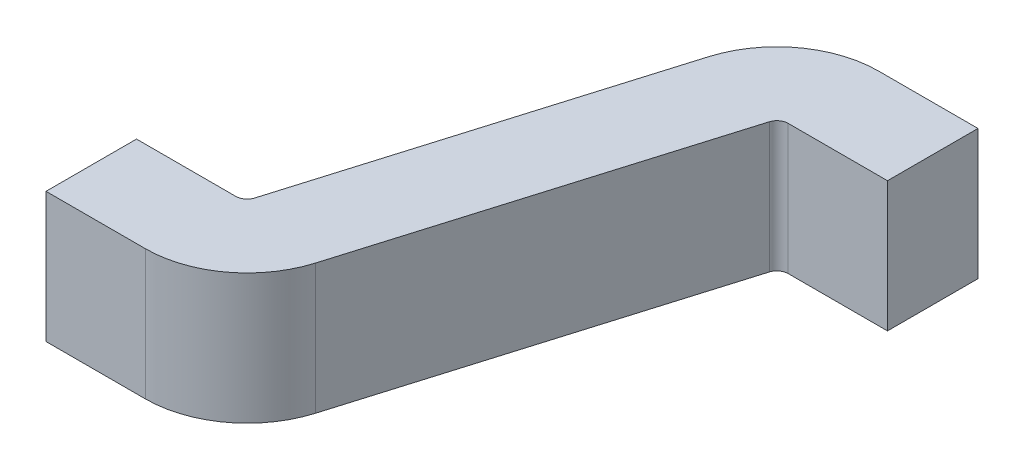
ISO-10303-21;
HEADER;
FILE_DESCRIPTION(('STEP AP214'),'2;1');
FILE_NAME('part.step','',(''),(''),'','','');
FILE_SCHEMA(('AUTOMOTIVE_DESIGN { 1 0 10303 214 1 1 1 1 }'));
ENDSEC;
DATA;
#1=APPLICATION_CONTEXT('core data for automotive mechanical design processes');
#2=APPLICATION_PROTOCOL_DEFINITION('international standard','automotive_design',2000,#1);
#3=PRODUCT_CONTEXT('',#1,'mechanical');
#4=PRODUCT('Part','Part','',(#3));
#5=PRODUCT_RELATED_PRODUCT_CATEGORY('part','',(#4));
#6=PRODUCT_DEFINITION_FORMATION('','',#4);
#7=PRODUCT_DEFINITION_CONTEXT('part definition',#1,'design');
#8=PRODUCT_DEFINITION('design','',#6,#7);
#9=PRODUCT_DEFINITION_SHAPE('','',#8);
#10=(LENGTH_UNIT() NAMED_UNIT(*) SI_UNIT(.MILLI.,.METRE.));
#11=(NAMED_UNIT(*) PLANE_ANGLE_UNIT() SI_UNIT($,.RADIAN.));
#12=(NAMED_UNIT(*) SI_UNIT($,.STERADIAN.) SOLID_ANGLE_UNIT());
#13=UNCERTAINTY_MEASURE_WITH_UNIT(LENGTH_MEASURE(1.E-05),#10,'distance_accuracy_value','');
#14=(GEOMETRIC_REPRESENTATION_CONTEXT(3) GLOBAL_UNCERTAINTY_ASSIGNED_CONTEXT((#13)) GLOBAL_UNIT_ASSIGNED_CONTEXT((#10,
#11,#12)) REPRESENTATION_CONTEXT('',''));
#15=CARTESIAN_POINT('',(0.,0.,0.));
#16=DIRECTION('',(0.,0.,1.));
#17=DIRECTION('',(1.,0.,0.));
#18=AXIS2_PLACEMENT_3D('',#15,#16,#17);
#19=CARTESIAN_POINT('',(0.,0.23,0.16));
#20=DIRECTION('',(1.,0.,0.));
#21=DIRECTION('',(0.,0.,-1.));
#22=AXIS2_PLACEMENT_3D('',#19,#20,#21);
#23=PLANE('',#22);
#24=DIRECTION('',(0.,0.,1.));
#25=VECTOR('',#24,1.);
#26=CARTESIAN_POINT('',(0.,-0.23,0.16));
#27=LINE('',#26,#25);
#28=CARTESIAN_POINT('',(0.,-0.23,-0.16));
#29=VERTEX_POINT('',#28);
#30=CARTESIAN_POINT('',(0.,-0.23,0.16));
#31=VERTEX_POINT('',#30);
#32=EDGE_CURVE('E164',#29,#31,#27,.T.);
#33=ORIENTED_EDGE('',*,*,#32,.T.);
#34=DIRECTION('',(0.,-1.,0.));
#35=VECTOR('',#34,1.);
#36=CARTESIAN_POINT('',(0.,0.23,0.16));
#37=LINE('',#36,#35);
#38=CARTESIAN_POINT('',(0.,0.23,0.16));
#39=VERTEX_POINT('',#38);
#40=EDGE_CURVE('E11',#39,#31,#37,.T.);
#41=ORIENTED_EDGE('',*,*,#40,.F.);
#42=DIRECTION('',(0.,0.,1.));
#43=VECTOR('',#42,1.);
#44=CARTESIAN_POINT('',(0.,0.23,0.16));
#45=LINE('',#44,#43);
#46=CARTESIAN_POINT('',(0.,0.23,-0.16));
#47=VERTEX_POINT('',#46);
#48=EDGE_CURVE('E198',#47,#39,#45,.T.);
#49=ORIENTED_EDGE('',*,*,#48,.F.);
#50=DIRECTION('',(0.,-1.,0.));
#51=VECTOR('',#50,1.);
#52=CARTESIAN_POINT('',(0.,0.23,-0.16));
#53=LINE('',#52,#51);
#54=EDGE_CURVE('E160',#47,#29,#53,.T.);
#55=ORIENTED_EDGE('',*,*,#54,.T.);
#56=EDGE_LOOP('',(#33,#41,#49,#55));
#57=FACE_BOUND('',#56,.T.);
#58=ADVANCED_FACE('F39',(#57),#23,.F.);
#59=CARTESIAN_POINT('',(0.,0.23,0.16));
#60=DIRECTION('',(0.,0.,-1.));
#61=DIRECTION('',(-1.,0.,0.));
#62=AXIS2_PLACEMENT_3D('',#59,#60,#61);
#63=PLANE('',#62);
#64=DIRECTION('',(1.,0.,0.));
#65=VECTOR('',#64,1.);
#66=CARTESIAN_POINT('',(0.,-0.23,0.16));
#67=LINE('',#66,#65);
#68=CARTESIAN_POINT('',(0.351100061765753,-0.23,0.16));
#69=VERTEX_POINT('',#68);
#70=EDGE_CURVE('E168',#31,#69,#67,.T.);
#71=ORIENTED_EDGE('',*,*,#70,.T.);
#72=DIRECTION('',(0.,-1.,0.));
#73=VECTOR('',#72,1.);
#74=CARTESIAN_POINT('',(0.351100061765753,0.23,0.16));
#75=LINE('',#74,#73);
#76=CARTESIAN_POINT('',(0.351100061765753,0.23,0.16));
#77=VERTEX_POINT('',#76);
#78=EDGE_CURVE('E48',#77,#69,#75,.T.);
#79=ORIENTED_EDGE('',*,*,#78,.F.);
#80=DIRECTION('',(1.,0.,0.));
#81=VECTOR('',#80,1.);
#82=CARTESIAN_POINT('',(0.,0.23,0.16));
#83=LINE('',#82,#81);
#84=EDGE_CURVE('E111',#39,#77,#83,.T.);
#85=ORIENTED_EDGE('',*,*,#84,.F.);
#86=ORIENTED_EDGE('',*,*,#40,.T.);
#87=EDGE_LOOP('',(#71,#79,#85,#86));
#88=FACE_BOUND('',#87,.T.);
#89=ADVANCED_FACE('F292',(#88),#63,.F.);
#90=CARTESIAN_POINT('',(0.351100061765753,0.23,-0.2));
#91=DIRECTION('',(0.,-1.,0.));
#92=DIRECTION('',(0.,0.,-1.));
#93=AXIS2_PLACEMENT_3D('',#90,#91,#92);
#94=CYLINDRICAL_SURFACE('',#93,0.36);
#95=CARTESIAN_POINT('',(0.351100061765753,-0.23,-0.2));
#96=DIRECTION('',(0.,1.,0.));
#97=DIRECTION('',(0.,0.,1.));
#98=AXIS2_PLACEMENT_3D('',#95,#96,#97);
#99=CIRCLE('',#98,0.36);
#100=CARTESIAN_POINT('',(0.695979909679207,-0.23,-0.0967629402627489));
#101=VERTEX_POINT('',#100);
#102=EDGE_CURVE('E171',#69,#101,#99,.T.);
#103=ORIENTED_EDGE('',*,*,#102,.T.);
#104=DIRECTION('',(0.,-1.,0.));
#105=VECTOR('',#104,1.);
#106=CARTESIAN_POINT('',(0.695979909679207,0.23,-0.0967629402627489));
#107=LINE('',#106,#105);
#108=CARTESIAN_POINT('',(0.695979909679207,0.23,-0.0967629402627489));
#109=VERTEX_POINT('',#108);
#110=EDGE_CURVE('E225',#109,#101,#107,.T.);
#111=ORIENTED_EDGE('',*,*,#110,.F.);
#112=CARTESIAN_POINT('',(0.351100061765753,0.23,-0.2));
#113=DIRECTION('',(0.,1.,0.));
#114=DIRECTION('',(0.,0.,1.));
#115=AXIS2_PLACEMENT_3D('',#112,#113,#114);
#116=CIRCLE('',#115,0.36);
#117=EDGE_CURVE('E235',#77,#109,#116,.T.);
#118=ORIENTED_EDGE('',*,*,#117,.F.);
#119=ORIENTED_EDGE('',*,*,#78,.T.);
#120=EDGE_LOOP('',(#103,#111,#118,#119));
#121=FACE_BOUND('',#120,.T.);
#122=ADVANCED_FACE('F233',(#121),#94,.T.);
#123=CARTESIAN_POINT('',(0.695979909679207,0.23,-0.0967629402627489));
#124=DIRECTION('',(-0.957999577537373,0.,-0.286769610381253));
#125=DIRECTION('',(-0.286769610381253,0.,0.957999577537373));
#126=AXIS2_PLACEMENT_3D('',#123,#124,#125);
#127=PLANE('',#126);
#128=DIRECTION('',(0.286769610381253,0.,-0.957999577537373));
#129=VECTOR('',#128,1.);
#130=CARTESIAN_POINT('',(0.695979909679207,-0.23,-0.0967629402627489));
#131=LINE('',#130,#129);
#132=CARTESIAN_POINT('',(1.06557995513275,-0.23,-1.33147078441525));
#133=VERTEX_POINT('',#132);
#134=EDGE_CURVE('E174',#101,#133,#131,.T.);
#135=ORIENTED_EDGE('',*,*,#134,.T.);
#136=DIRECTION('',(0.,-1.,0.));
#137=VECTOR('',#136,1.);
#138=CARTESIAN_POINT('',(1.06557995513275,0.23,-1.33147078441525));
#139=LINE('',#138,#137);
#140=CARTESIAN_POINT('',(1.06557995513275,0.23,-1.33147078441525));
#141=VERTEX_POINT('',#140);
#142=EDGE_CURVE('E221',#141,#133,#139,.T.);
#143=ORIENTED_EDGE('',*,*,#142,.F.);
#144=DIRECTION('',(0.286769610381253,0.,-0.957999577537373));
#145=VECTOR('',#144,1.);
#146=CARTESIAN_POINT('',(0.695979909679207,0.23,-0.0967629402627489));
#147=LINE('',#146,#145);
#148=EDGE_CURVE('E254',#109,#141,#147,.T.);
#149=ORIENTED_EDGE('',*,*,#148,.F.);
#150=ORIENTED_EDGE('',*,*,#110,.T.);
#151=EDGE_LOOP('',(#135,#143,#149,#150));
#152=FACE_BOUND('',#151,.T.);
#153=ADVANCED_FACE('F244',(#152),#127,.F.);
#154=CARTESIAN_POINT('',(1.10389993823425,0.23,-1.32));
#155=DIRECTION('',(0.,-1.,0.));
#156=DIRECTION('',(0.,0.,-1.));
#157=AXIS2_PLACEMENT_3D('',#154,#155,#156);
#158=CYLINDRICAL_SURFACE('',#157,0.04);
#159=CARTESIAN_POINT('',(1.10389993823425,-0.23,-1.32));
#160=DIRECTION('',(0.,-1.,0.));
#161=DIRECTION('',(0.,0.,-1.));
#162=AXIS2_PLACEMENT_3D('',#159,#160,#161);
#163=CIRCLE('',#162,0.04);
#164=CARTESIAN_POINT('',(1.10389993823425,-0.23,-1.36));
#165=VERTEX_POINT('',#164);
#166=EDGE_CURVE('E177',#133,#165,#163,.T.);
#167=ORIENTED_EDGE('',*,*,#166,.T.);
#168=DIRECTION('',(0.,-1.,0.));
#169=VECTOR('',#168,1.);
#170=CARTESIAN_POINT('',(1.10389993823425,0.23,-1.36));
#171=LINE('',#170,#169);
#172=CARTESIAN_POINT('',(1.10389993823425,0.23,-1.36));
#173=VERTEX_POINT('',#172);
#174=EDGE_CURVE('E217',#173,#165,#171,.T.);
#175=ORIENTED_EDGE('',*,*,#174,.F.);
#176=CARTESIAN_POINT('',(1.10389993823425,0.23,-1.32));
#177=DIRECTION('',(0.,-1.,0.));
#178=DIRECTION('',(0.,0.,-1.));
#179=AXIS2_PLACEMENT_3D('',#176,#177,#178);
#180=CIRCLE('',#179,0.04);
#181=EDGE_CURVE('E250',#141,#173,#180,.T.);
#182=ORIENTED_EDGE('',*,*,#181,.F.);
#183=ORIENTED_EDGE('',*,*,#142,.T.);
#184=EDGE_LOOP('',(#167,#175,#182,#183));
#185=FACE_BOUND('',#184,.T.);
#186=ADVANCED_FACE('F248',(#185),#158,.F.);
#187=CARTESIAN_POINT('',(1.10389993823425,0.23,-1.36));
#188=DIRECTION('',(0.,0.,-1.));
#189=DIRECTION('',(-1.,0.,0.));
#190=AXIS2_PLACEMENT_3D('',#187,#188,#189);
#191=PLANE('',#190);
#192=DIRECTION('',(1.,0.,0.));
#193=VECTOR('',#192,1.);
#194=CARTESIAN_POINT('',(1.10389993823425,-0.23,-1.36));
#195=LINE('',#194,#193);
#196=CARTESIAN_POINT('',(1.455,-0.23,-1.36));
#197=VERTEX_POINT('',#196);
#198=EDGE_CURVE('E180',#165,#197,#195,.T.);
#199=ORIENTED_EDGE('',*,*,#198,.T.);
#200=DIRECTION('',(0.,-1.,0.));
#201=VECTOR('',#200,1.);
#202=CARTESIAN_POINT('',(1.455,0.23,-1.36));
#203=LINE('',#202,#201);
#204=CARTESIAN_POINT('',(1.455,0.23,-1.36));
#205=VERTEX_POINT('',#204);
#206=EDGE_CURVE('E213',#205,#197,#203,.T.);
#207=ORIENTED_EDGE('',*,*,#206,.F.);
#208=DIRECTION('',(1.,0.,0.));
#209=VECTOR('',#208,1.);
#210=CARTESIAN_POINT('',(1.10389993823425,0.23,-1.36));
#211=LINE('',#210,#209);
#212=EDGE_CURVE('E253',#173,#205,#211,.T.);
#213=ORIENTED_EDGE('',*,*,#212,.F.);
#214=ORIENTED_EDGE('',*,*,#174,.T.);
#215=EDGE_LOOP('',(#199,#207,#213,#214));
#216=FACE_BOUND('',#215,.T.);
#217=ADVANCED_FACE('F305',(#216),#191,.F.);
#218=CARTESIAN_POINT('',(1.455,0.23,-1.36));
#219=DIRECTION('',(-1.,0.,0.));
#220=DIRECTION('',(0.,0.,1.));
#221=AXIS2_PLACEMENT_3D('',#218,#219,#220);
#222=PLANE('',#221);
#223=DIRECTION('',(0.,0.,-1.));
#224=VECTOR('',#223,1.);
#225=CARTESIAN_POINT('',(1.455,-0.23,-1.36));
#226=LINE('',#225,#224);
#227=CARTESIAN_POINT('',(1.455,-0.23,-1.68));
#228=VERTEX_POINT('',#227);
#229=EDGE_CURVE('E183',#197,#228,#226,.T.);
#230=ORIENTED_EDGE('',*,*,#229,.T.);
#231=DIRECTION('',(0.,-1.,0.));
#232=VECTOR('',#231,1.);
#233=CARTESIAN_POINT('',(1.455,0.23,-1.68));
#234=LINE('',#233,#232);
#235=CARTESIAN_POINT('',(1.455,0.23,-1.68));
#236=VERTEX_POINT('',#235);
#237=EDGE_CURVE('E209',#236,#228,#234,.T.);
#238=ORIENTED_EDGE('',*,*,#237,.F.);
#239=DIRECTION('',(0.,0.,-1.));
#240=VECTOR('',#239,1.);
#241=CARTESIAN_POINT('',(1.455,0.23,-1.36));
#242=LINE('',#241,#240);
#243=EDGE_CURVE('E258',#205,#236,#242,.T.);
#244=ORIENTED_EDGE('',*,*,#243,.F.);
#245=ORIENTED_EDGE('',*,*,#206,.T.);
#246=EDGE_LOOP('',(#230,#238,#244,#245));
#247=FACE_BOUND('',#246,.T.);
#248=ADVANCED_FACE('F308',(#247),#222,.F.);
#249=CARTESIAN_POINT('',(1.10389993823425,0.23,-1.68));
#250=DIRECTION('',(0.,0.,1.));
#251=DIRECTION('',(1.,0.,0.));
#252=AXIS2_PLACEMENT_3D('',#249,#250,#251);
#253=PLANE('',#252);
#254=DIRECTION('',(-1.,0.,0.));
#255=VECTOR('',#254,1.);
#256=CARTESIAN_POINT('',(1.10389993823425,-0.23,-1.68));
#257=LINE('',#256,#255);
#258=CARTESIAN_POINT('',(1.10389993823425,-0.23,-1.68));
#259=VERTEX_POINT('',#258);
#260=EDGE_CURVE('E186',#228,#259,#257,.T.);
#261=ORIENTED_EDGE('',*,*,#260,.T.);
#262=DIRECTION('',(0.,-1.,0.));
#263=VECTOR('',#262,1.);
#264=CARTESIAN_POINT('',(1.10389993823425,0.23,-1.68));
#265=LINE('',#264,#263);
#266=CARTESIAN_POINT('',(1.10389993823425,0.23,-1.68));
#267=VERTEX_POINT('',#266);
#268=EDGE_CURVE('E205',#267,#259,#265,.T.);
#269=ORIENTED_EDGE('',*,*,#268,.F.);
#270=DIRECTION('',(-1.,0.,0.));
#271=VECTOR('',#270,1.);
#272=CARTESIAN_POINT('',(1.10389993823425,0.23,-1.68));
#273=LINE('',#272,#271);
#274=EDGE_CURVE('E265',#236,#267,#273,.T.);
#275=ORIENTED_EDGE('',*,*,#274,.F.);
#276=ORIENTED_EDGE('',*,*,#237,.T.);
#277=EDGE_LOOP('',(#261,#269,#275,#276));
#278=FACE_BOUND('',#277,.T.);
#279=ADVANCED_FACE('F273',(#278),#253,.F.);
#280=CARTESIAN_POINT('',(1.10389993823425,0.23,-1.32));
#281=DIRECTION('',(0.,-1.,0.));
#282=DIRECTION('',(0.,0.,-1.));
#283=AXIS2_PLACEMENT_3D('',#280,#281,#282);
#284=CYLINDRICAL_SURFACE('',#283,0.36);
#285=CARTESIAN_POINT('',(1.10389993823425,-0.23,-1.32));
#286=DIRECTION('',(0.,1.,0.));
#287=DIRECTION('',(0.,0.,-1.));
#288=AXIS2_PLACEMENT_3D('',#285,#286,#287);
#289=CIRCLE('',#288,0.36);
#290=CARTESIAN_POINT('',(0.759020090320793,-0.23,-1.42323705973725));
#291=VERTEX_POINT('',#290);
#292=EDGE_CURVE('E189',#259,#291,#289,.T.);
#293=ORIENTED_EDGE('',*,*,#292,.T.);
#294=DIRECTION('',(0.,-1.,0.));
#295=VECTOR('',#294,1.);
#296=CARTESIAN_POINT('',(0.759020090320793,0.23,-1.42323705973725));
#297=LINE('',#296,#295);
#298=CARTESIAN_POINT('',(0.759020090320793,0.23,-1.42323705973725));
#299=VERTEX_POINT('',#298);
#300=EDGE_CURVE('E153',#299,#291,#297,.T.);
#301=ORIENTED_EDGE('',*,*,#300,.F.);
#302=CARTESIAN_POINT('',(1.10389993823425,0.23,-1.32));
#303=DIRECTION('',(0.,1.,0.));
#304=DIRECTION('',(0.,0.,-1.));
#305=AXIS2_PLACEMENT_3D('',#302,#303,#304);
#306=CIRCLE('',#305,0.36);
#307=EDGE_CURVE('E142',#267,#299,#306,.T.);
#308=ORIENTED_EDGE('',*,*,#307,.F.);
#309=ORIENTED_EDGE('',*,*,#268,.T.);
#310=EDGE_LOOP('',(#293,#301,#308,#309));
#311=FACE_BOUND('',#310,.T.);
#312=ADVANCED_FACE('F277',(#311),#284,.T.);
#313=CARTESIAN_POINT('',(0.389420044867248,0.23,-0.18852921558475));
#314=DIRECTION('',(0.957999577537373,0.,0.286769610381253));
#315=DIRECTION('',(0.286769610381253,0.,-0.957999577537373));
#316=AXIS2_PLACEMENT_3D('',#313,#314,#315);
#317=PLANE('',#316);
#318=DIRECTION('',(-0.286769610381253,0.,0.957999577537373));
#319=VECTOR('',#318,1.);
#320=CARTESIAN_POINT('',(0.389420044867248,-0.23,-0.18852921558475));
#321=LINE('',#320,#319);
#322=CARTESIAN_POINT('',(0.389420044867248,-0.23,-0.18852921558475));
#323=VERTEX_POINT('',#322);
#324=EDGE_CURVE('E151',#291,#323,#321,.T.);
#325=ORIENTED_EDGE('',*,*,#324,.T.);
#326=DIRECTION('',(0.,-1.,0.));
#327=VECTOR('',#326,1.);
#328=CARTESIAN_POINT('',(0.389420044867248,0.23,-0.18852921558475));
#329=LINE('',#328,#327);
#330=CARTESIAN_POINT('',(0.389420044867248,0.23,-0.18852921558475));
#331=VERTEX_POINT('',#330);
#332=EDGE_CURVE('E148',#331,#323,#329,.T.);
#333=ORIENTED_EDGE('',*,*,#332,.F.);
#334=DIRECTION('',(-0.286769610381253,0.,0.957999577537373));
#335=VECTOR('',#334,1.);
#336=CARTESIAN_POINT('',(0.389420044867248,0.23,-0.18852921558475));
#337=LINE('',#336,#335);
#338=EDGE_CURVE('E136',#299,#331,#337,.T.);
#339=ORIENTED_EDGE('',*,*,#338,.F.);
#340=ORIENTED_EDGE('',*,*,#300,.T.);
#341=EDGE_LOOP('',(#325,#333,#339,#340));
#342=FACE_BOUND('',#341,.T.);
#343=ADVANCED_FACE('F149',(#342),#317,.F.);
#344=CARTESIAN_POINT('',(0.351100061765753,0.23,-0.2));
#345=DIRECTION('',(0.,-1.,0.));
#346=DIRECTION('',(0.,0.,-1.));
#347=AXIS2_PLACEMENT_3D('',#344,#345,#346);
#348=CYLINDRICAL_SURFACE('',#347,0.04);
#349=CARTESIAN_POINT('',(0.351100061765753,-0.23,-0.2));
#350=DIRECTION('',(0.,-1.,0.));
#351=DIRECTION('',(0.,0.,1.));
#352=AXIS2_PLACEMENT_3D('',#349,#350,#351);
#353=CIRCLE('',#352,0.04);
#354=CARTESIAN_POINT('',(0.351100061765753,-0.23,-0.16));
#355=VERTEX_POINT('',#354);
#356=EDGE_CURVE('E97',#323,#355,#353,.T.);
#357=ORIENTED_EDGE('',*,*,#356,.T.);
#358=DIRECTION('',(0.,-1.,0.));
#359=VECTOR('',#358,1.);
#360=CARTESIAN_POINT('',(0.351100061765753,0.23,-0.16));
#361=LINE('',#360,#359);
#362=CARTESIAN_POINT('',(0.351100061765753,0.23,-0.16));
#363=VERTEX_POINT('',#362);
#364=EDGE_CURVE('E154',#363,#355,#361,.T.);
#365=ORIENTED_EDGE('',*,*,#364,.F.);
#366=CARTESIAN_POINT('',(0.351100061765753,0.23,-0.2));
#367=DIRECTION('',(0.,-1.,0.));
#368=DIRECTION('',(0.,0.,1.));
#369=AXIS2_PLACEMENT_3D('',#366,#367,#368);
#370=CIRCLE('',#369,0.04);
#371=EDGE_CURVE('E140',#331,#363,#370,.T.);
#372=ORIENTED_EDGE('',*,*,#371,.F.);
#373=ORIENTED_EDGE('',*,*,#332,.T.);
#374=EDGE_LOOP('',(#357,#365,#372,#373));
#375=FACE_BOUND('',#374,.T.);
#376=ADVANCED_FACE('F156',(#375),#348,.F.);
#377=CARTESIAN_POINT('',(0.,0.23,-0.16));
#378=DIRECTION('',(0.,0.,1.));
#379=DIRECTION('',(1.,0.,0.));
#380=AXIS2_PLACEMENT_3D('',#377,#378,#379);
#381=PLANE('',#380);
#382=DIRECTION('',(-1.,0.,0.));
#383=VECTOR('',#382,1.);
#384=CARTESIAN_POINT('',(0.,-0.23,-0.16));
#385=LINE('',#384,#383);
#386=EDGE_CURVE('E103',#355,#29,#385,.T.);
#387=ORIENTED_EDGE('',*,*,#386,.T.);
#388=ORIENTED_EDGE('',*,*,#54,.F.);
#389=DIRECTION('',(-1.,0.,0.));
#390=VECTOR('',#389,1.);
#391=CARTESIAN_POINT('',(0.,0.23,-0.16));
#392=LINE('',#391,#390);
#393=EDGE_CURVE('E56',#363,#47,#392,.T.);
#394=ORIENTED_EDGE('',*,*,#393,.F.);
#395=ORIENTED_EDGE('',*,*,#364,.T.);
#396=EDGE_LOOP('',(#387,#388,#394,#395));
#397=FACE_BOUND('',#396,.T.);
#398=ADVANCED_FACE('F281',(#397),#381,.F.);
#399=CARTESIAN_POINT('',(0.351100061765753,0.23,-0.2));
#400=DIRECTION('',(0.,1.,0.));
#401=DIRECTION('',(0.,0.,1.));
#402=AXIS2_PLACEMENT_3D('',#399,#400,#401);
#403=PLANE('',#402);
#404=ORIENTED_EDGE('',*,*,#48,.T.);
#405=ORIENTED_EDGE('',*,*,#84,.T.);
#406=ORIENTED_EDGE('',*,*,#117,.T.);
#407=ORIENTED_EDGE('',*,*,#148,.T.);
#408=ORIENTED_EDGE('',*,*,#181,.T.);
#409=ORIENTED_EDGE('',*,*,#212,.T.);
#410=ORIENTED_EDGE('',*,*,#243,.T.);
#411=ORIENTED_EDGE('',*,*,#274,.T.);
#412=ORIENTED_EDGE('',*,*,#307,.T.);
#413=ORIENTED_EDGE('',*,*,#338,.T.);
#414=ORIENTED_EDGE('',*,*,#371,.T.);
#415=ORIENTED_EDGE('',*,*,#393,.T.);
#416=EDGE_LOOP('',(#404,#405,#406,#407,#408,#409,#410,#411,#412,#413,#414,#415));
#417=FACE_BOUND('',#416,.T.);
#418=ADVANCED_FACE('F138',(#417),#403,.T.);
#419=CARTESIAN_POINT('',(0.351100061765753,-0.23,-0.2));
#420=DIRECTION('',(0.,1.,0.));
#421=DIRECTION('',(0.,0.,1.));
#422=AXIS2_PLACEMENT_3D('',#419,#420,#421);
#423=PLANE('',#422);
#424=ORIENTED_EDGE('',*,*,#32,.F.);
#425=ORIENTED_EDGE('',*,*,#386,.F.);
#426=ORIENTED_EDGE('',*,*,#356,.F.);
#427=ORIENTED_EDGE('',*,*,#324,.F.);
#428=ORIENTED_EDGE('',*,*,#292,.F.);
#429=ORIENTED_EDGE('',*,*,#260,.F.);
#430=ORIENTED_EDGE('',*,*,#229,.F.);
#431=ORIENTED_EDGE('',*,*,#198,.F.);
#432=ORIENTED_EDGE('',*,*,#166,.F.);
#433=ORIENTED_EDGE('',*,*,#134,.F.);
#434=ORIENTED_EDGE('',*,*,#102,.F.);
#435=ORIENTED_EDGE('',*,*,#70,.F.);
#436=EDGE_LOOP('',(#424,#425,#426,#427,#428,#429,#430,#431,#432,#433,#434,#435));
#437=FACE_BOUND('',#436,.T.);
#438=ADVANCED_FACE('F239',(#437),#423,.F.);
#439=CLOSED_SHELL('',(#58,#89,#122,#153,#186,#217,#248,#279,#312,#343,#376,#398,#418,#438));
#440=MANIFOLD_SOLID_BREP('B2',#439);
#441=ADVANCED_BREP_SHAPE_REPRESENTATION('',(#18,#440),#14);
#442=SHAPE_DEFINITION_REPRESENTATION(#9,#441);
ENDSEC;
END-ISO-10303-21;
